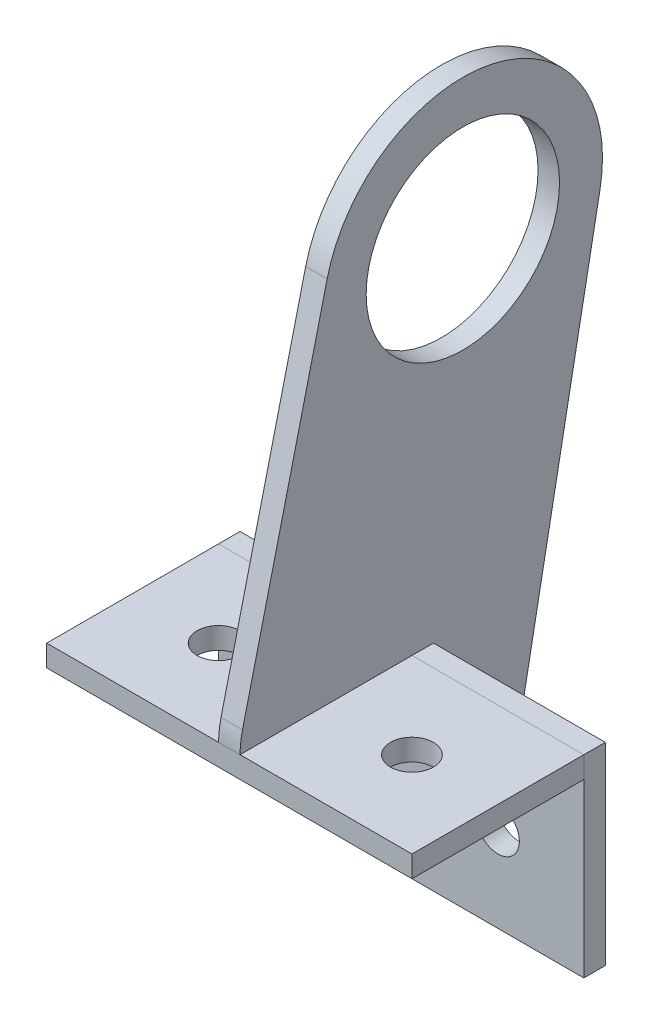
ISO-10303-21;
HEADER;
FILE_DESCRIPTION(('STEP AP214'),'2;1');
FILE_NAME('part.step','',(''),(''),'','','');
FILE_SCHEMA(('AUTOMOTIVE_DESIGN { 1 0 10303 214 1 1 1 1 }'));
ENDSEC;
DATA;
#1=APPLICATION_CONTEXT('core data for automotive mechanical design processes');
#2=APPLICATION_PROTOCOL_DEFINITION('international standard','automotive_design',2000,#1);
#3=PRODUCT_CONTEXT('',#1,'mechanical');
#4=PRODUCT('Part','Part','',(#3));
#5=PRODUCT_RELATED_PRODUCT_CATEGORY('part','',(#4));
#6=PRODUCT_DEFINITION_FORMATION('','',#4);
#7=PRODUCT_DEFINITION_CONTEXT('part definition',#1,'design');
#8=PRODUCT_DEFINITION('design','',#6,#7);
#9=PRODUCT_DEFINITION_SHAPE('','',#8);
#10=(LENGTH_UNIT() NAMED_UNIT(*) SI_UNIT(.MILLI.,.METRE.));
#11=(NAMED_UNIT(*) PLANE_ANGLE_UNIT() SI_UNIT($,.RADIAN.));
#12=(NAMED_UNIT(*) SI_UNIT($,.STERADIAN.) SOLID_ANGLE_UNIT());
#13=UNCERTAINTY_MEASURE_WITH_UNIT(LENGTH_MEASURE(1.E-05),#10,'distance_accuracy_value','');
#14=(GEOMETRIC_REPRESENTATION_CONTEXT(3) GLOBAL_UNCERTAINTY_ASSIGNED_CONTEXT((#13)) GLOBAL_UNIT_ASSIGNED_CONTEXT((#10,
#11,#12)) REPRESENTATION_CONTEXT('',''));
#15=CARTESIAN_POINT('',(0.,0.,0.));
#16=DIRECTION('',(0.,0.,1.));
#17=DIRECTION('',(1.,0.,0.));
#18=AXIS2_PLACEMENT_3D('',#15,#16,#17);
#19=CARTESIAN_POINT('',(-26.9875,-49.5999999999818,32.9250000000001));
#20=DIRECTION('',(1.,0.,0.));
#21=DIRECTION('',(0.,0.,-1.));
#22=AXIS2_PLACEMENT_3D('',#19,#20,#21);
#23=PLANE('',#22);
#24=DIRECTION('',(0.,-1.,0.));
#25=VECTOR('',#24,1.);
#26=CARTESIAN_POINT('',(-26.9875,-49.5999999999818,7.5250000000001));
#27=LINE('',#26,#25);
#28=CARTESIAN_POINT('',(-26.9875,-49.5999999999818,7.5250000000001));
#29=VERTEX_POINT('',#28);
#30=CARTESIAN_POINT('',(-26.9875,-52.7749999999818,7.5250000000001));
#31=VERTEX_POINT('',#30);
#32=EDGE_CURVE('E113',#29,#31,#27,.T.);
#33=ORIENTED_EDGE('',*,*,#32,.T.);
#34=DIRECTION('',(0.,0.,-1.));
#35=VECTOR('',#34,1.);
#36=CARTESIAN_POINT('',(-26.9875,-52.7749999999818,32.9250000000001));
#37=LINE('',#36,#35);
#38=CARTESIAN_POINT('',(-26.9875,-52.7749999999818,32.9250000000001));
#39=VERTEX_POINT('',#38);
#40=EDGE_CURVE('E12',#39,#31,#37,.T.);
#41=ORIENTED_EDGE('',*,*,#40,.F.);
#42=DIRECTION('',(0.,-1.,0.));
#43=VECTOR('',#42,1.);
#44=CARTESIAN_POINT('',(-26.9875,-49.5999999999818,32.9250000000001));
#45=LINE('',#44,#43);
#46=CARTESIAN_POINT('',(-26.9875,-49.5999999999818,32.9250000000001));
#47=VERTEX_POINT('',#46);
#48=EDGE_CURVE('E101',#47,#39,#45,.T.);
#49=ORIENTED_EDGE('',*,*,#48,.F.);
#50=DIRECTION('',(0.,0.,-1.));
#51=VECTOR('',#50,1.);
#52=CARTESIAN_POINT('',(-26.9875,-49.5999999999818,32.9250000000001));
#53=LINE('',#52,#51);
#54=EDGE_CURVE('E109',#47,#29,#53,.T.);
#55=ORIENTED_EDGE('',*,*,#54,.T.);
#56=EDGE_LOOP('',(#33,#41,#49,#55));
#57=FACE_BOUND('',#56,.T.);
#58=ADVANCED_FACE('F50',(#57),#23,.F.);
#59=CARTESIAN_POINT('',(-26.9875,-52.7749999999818,32.9250000000001));
#60=DIRECTION('',(0.,1.,0.));
#61=DIRECTION('',(0.,0.,1.));
#62=AXIS2_PLACEMENT_3D('',#59,#60,#61);
#63=PLANE('',#62);
#64=CARTESIAN_POINT('',(14.2875,-52.7749999999818,20.225));
#65=DIRECTION('',(0.,1.,0.));
#66=DIRECTION('',(0.,0.,1.));
#67=AXIS2_PLACEMENT_3D('',#64,#65,#66);
#68=CIRCLE('',#67,3.175);
#69=CARTESIAN_POINT('',(14.2875,-52.7749999999818,23.4000000000001));
#70=VERTEX_POINT('',#69);
#71=EDGE_CURVE('E132',#70,#70,#68,.T.);
#72=ORIENTED_EDGE('',*,*,#71,.T.);
#73=EDGE_LOOP('',(#72));
#74=FACE_BOUND('',#73,.T.);
#75=CARTESIAN_POINT('',(-14.2875,-52.7749999999818,20.225));
#76=DIRECTION('',(0.,1.,0.));
#77=DIRECTION('',(0.,0.,1.));
#78=AXIS2_PLACEMENT_3D('',#75,#76,#77);
#79=CIRCLE('',#78,3.175);
#80=CARTESIAN_POINT('',(-14.2875,-52.7749999999818,23.4));
#81=VERTEX_POINT('',#80);
#82=EDGE_CURVE('E116',#81,#81,#79,.T.);
#83=ORIENTED_EDGE('',*,*,#82,.T.);
#84=EDGE_LOOP('',(#83));
#85=FACE_BOUND('',#84,.T.);
#86=DIRECTION('',(1.,0.,0.));
#87=VECTOR('',#86,1.);
#88=CARTESIAN_POINT('',(-26.9875,-52.7749999999818,7.5250000000001));
#89=LINE('',#88,#87);
#90=CARTESIAN_POINT('',(26.9875,-52.7749999999818,7.5250000000001));
#91=VERTEX_POINT('',#90);
#92=EDGE_CURVE('E105',#31,#91,#89,.T.);
#93=ORIENTED_EDGE('',*,*,#92,.T.);
#94=DIRECTION('',(0.,0.,-1.));
#95=VECTOR('',#94,1.);
#96=CARTESIAN_POINT('',(26.9875,-52.7749999999818,32.9250000000001));
#97=LINE('',#96,#95);
#98=CARTESIAN_POINT('',(26.9875,-52.7749999999818,32.9250000000001));
#99=VERTEX_POINT('',#98);
#100=EDGE_CURVE('E58',#99,#91,#97,.T.);
#101=ORIENTED_EDGE('',*,*,#100,.F.);
#102=DIRECTION('',(1.,0.,0.));
#103=VECTOR('',#102,1.);
#104=CARTESIAN_POINT('',(-26.9875,-52.7749999999818,32.9250000000001));
#105=LINE('',#104,#103);
#106=EDGE_CURVE('E96',#39,#99,#105,.T.);
#107=ORIENTED_EDGE('',*,*,#106,.F.);
#108=ORIENTED_EDGE('',*,*,#40,.T.);
#109=EDGE_LOOP('',(#93,#101,#107,#108));
#110=FACE_BOUND('',#109,.T.);
#111=ADVANCED_FACE('F104',(#74,#85,#110),#63,.F.);
#112=CARTESIAN_POINT('',(26.9875,-49.5999999999818,32.9250000000001));
#113=DIRECTION('',(-1.,0.,0.));
#114=DIRECTION('',(0.,0.,1.));
#115=AXIS2_PLACEMENT_3D('',#112,#113,#114);
#116=PLANE('',#115);
#117=DIRECTION('',(0.,1.,0.));
#118=VECTOR('',#117,1.);
#119=CARTESIAN_POINT('',(26.9875,-49.5999999999818,7.5250000000001));
#120=LINE('',#119,#118);
#121=CARTESIAN_POINT('',(26.9875,-49.5999999999818,7.5250000000001));
#122=VERTEX_POINT('',#121);
#123=EDGE_CURVE('E83',#91,#122,#120,.T.);
#124=ORIENTED_EDGE('',*,*,#123,.T.);
#125=DIRECTION('',(0.,0.,-1.));
#126=VECTOR('',#125,1.);
#127=CARTESIAN_POINT('',(26.9875,-49.5999999999818,32.9250000000001));
#128=LINE('',#127,#126);
#129=CARTESIAN_POINT('',(26.9875,-49.5999999999818,32.9250000000001));
#130=VERTEX_POINT('',#129);
#131=EDGE_CURVE('E106',#130,#122,#128,.T.);
#132=ORIENTED_EDGE('',*,*,#131,.F.);
#133=DIRECTION('',(0.,1.,0.));
#134=VECTOR('',#133,1.);
#135=CARTESIAN_POINT('',(26.9875,-49.5999999999818,32.9250000000001));
#136=LINE('',#135,#134);
#137=EDGE_CURVE('E99',#99,#130,#136,.T.);
#138=ORIENTED_EDGE('',*,*,#137,.F.);
#139=ORIENTED_EDGE('',*,*,#100,.T.);
#140=EDGE_LOOP('',(#124,#132,#138,#139));
#141=FACE_BOUND('',#140,.T.);
#142=ADVANCED_FACE('F107',(#141),#116,.F.);
#143=CARTESIAN_POINT('',(-26.9875,-49.5999999999818,32.9250000000001));
#144=DIRECTION('',(0.,-1.,0.));
#145=DIRECTION('',(0.,0.,-1.));
#146=AXIS2_PLACEMENT_3D('',#143,#144,#145);
#147=PLANE('',#146);
#148=CARTESIAN_POINT('',(14.2875,-49.5999999999818,20.225));
#149=DIRECTION('',(0.,1.,0.));
#150=DIRECTION('',(0.,0.,1.));
#151=AXIS2_PLACEMENT_3D('',#148,#149,#150);
#152=CIRCLE('',#151,3.175);
#153=CARTESIAN_POINT('',(14.2875,-49.5999999999818,23.4000000000001));
#154=VERTEX_POINT('',#153);
#155=EDGE_CURVE('E135',#154,#154,#152,.T.);
#156=ORIENTED_EDGE('',*,*,#155,.F.);
#157=EDGE_LOOP('',(#156));
#158=FACE_BOUND('',#157,.T.);
#159=CARTESIAN_POINT('',(-14.2875,-49.5999999999818,20.225));
#160=DIRECTION('',(0.,1.,0.));
#161=DIRECTION('',(0.,0.,1.));
#162=AXIS2_PLACEMENT_3D('',#159,#160,#161);
#163=CIRCLE('',#162,3.175);
#164=CARTESIAN_POINT('',(-14.2875,-49.5999999999818,23.4));
#165=VERTEX_POINT('',#164);
#166=EDGE_CURVE('E129',#165,#165,#163,.T.);
#167=ORIENTED_EDGE('',*,*,#166,.F.);
#168=EDGE_LOOP('',(#167));
#169=FACE_BOUND('',#168,.T.);
#170=DIRECTION('',(-1.,0.,0.));
#171=VECTOR('',#170,1.);
#172=CARTESIAN_POINT('',(-26.9875,-49.5999999999818,7.5250000000001));
#173=LINE('',#172,#171);
#174=EDGE_CURVE('E89',#122,#29,#173,.T.);
#175=ORIENTED_EDGE('',*,*,#174,.T.);
#176=ORIENTED_EDGE('',*,*,#54,.F.);
#177=DIRECTION('',(-1.,0.,0.));
#178=VECTOR('',#177,1.);
#179=CARTESIAN_POINT('',(-26.9875,-49.5999999999818,32.9250000000001));
#180=LINE('',#179,#178);
#181=EDGE_CURVE('E66',#130,#47,#180,.T.);
#182=ORIENTED_EDGE('',*,*,#181,.F.);
#183=ORIENTED_EDGE('',*,*,#131,.T.);
#184=EDGE_LOOP('',(#175,#176,#182,#183));
#185=FACE_BOUND('',#184,.T.);
#186=ADVANCED_FACE('F121',(#158,#169,#185),#147,.F.);
#187=CARTESIAN_POINT('',(0.,0.,32.9250000000001));
#188=DIRECTION('',(0.,0.,1.));
#189=DIRECTION('',(1.,0.,0.));
#190=AXIS2_PLACEMENT_3D('',#187,#188,#189);
#191=PLANE('',#190);
#192=ORIENTED_EDGE('',*,*,#48,.T.);
#193=ORIENTED_EDGE('',*,*,#106,.T.);
#194=ORIENTED_EDGE('',*,*,#137,.T.);
#195=ORIENTED_EDGE('',*,*,#181,.T.);
#196=EDGE_LOOP('',(#192,#193,#194,#195));
#197=FACE_BOUND('',#196,.T.);
#198=ADVANCED_FACE('F97',(#197),#191,.T.);
#199=CARTESIAN_POINT('',(0.,0.,7.5250000000001));
#200=DIRECTION('',(0.,0.,1.));
#201=DIRECTION('',(1.,0.,0.));
#202=AXIS2_PLACEMENT_3D('',#199,#200,#201);
#203=PLANE('',#202);
#204=ORIENTED_EDGE('',*,*,#32,.F.);
#205=ORIENTED_EDGE('',*,*,#174,.F.);
#206=ORIENTED_EDGE('',*,*,#123,.F.);
#207=ORIENTED_EDGE('',*,*,#92,.F.);
#208=EDGE_LOOP('',(#204,#205,#206,#207));
#209=FACE_BOUND('',#208,.T.);
#210=ADVANCED_FACE('F124',(#209),#203,.F.);
#211=CARTESIAN_POINT('',(-14.2875,-78.1749999999818,20.225));
#212=DIRECTION('',(0.,1.,0.));
#213=DIRECTION('',(0.,0.,1.));
#214=AXIS2_PLACEMENT_3D('',#211,#212,#213);
#215=CYLINDRICAL_SURFACE('',#214,3.175);
#216=ORIENTED_EDGE('',*,*,#166,.T.);
#217=EDGE_LOOP('',(#216));
#218=FACE_BOUND('',#217,.T.);
#219=ORIENTED_EDGE('',*,*,#82,.F.);
#220=EDGE_LOOP('',(#219));
#221=FACE_BOUND('',#220,.T.);
#222=ADVANCED_FACE('F147',(#218,#221),#215,.F.);
#223=CARTESIAN_POINT('',(14.2875,-78.1749999999818,20.225));
#224=DIRECTION('',(0.,1.,0.));
#225=DIRECTION('',(0.,0.,1.));
#226=AXIS2_PLACEMENT_3D('',#223,#224,#225);
#227=CYLINDRICAL_SURFACE('',#226,3.175);
#228=ORIENTED_EDGE('',*,*,#155,.T.);
#229=EDGE_LOOP('',(#228));
#230=FACE_BOUND('',#229,.T.);
#231=ORIENTED_EDGE('',*,*,#71,.F.);
#232=EDGE_LOOP('',(#231));
#233=FACE_BOUND('',#232,.T.);
#234=ADVANCED_FACE('F139',(#230,#233),#227,.F.);
#235=CLOSED_SHELL('',(#58,#111,#142,#186,#198,#210,#222,#234));
#236=MANIFOLD_SOLID_BREP('B2',#235);
#237=CARTESIAN_POINT('',(0.,0.,7.5250000000001));
#238=DIRECTION('',(0.,0.,1.));
#239=DIRECTION('',(1.,0.,0.));
#240=AXIS2_PLACEMENT_3D('',#237,#238,#239);
#241=PLANE('',#240);
#242=CARTESIAN_POINT('',(14.2875,-65.4749999999818,7.5250000000001));
#243=DIRECTION('',(0.,0.,1.));
#244=DIRECTION('',(1.,0.,0.));
#245=AXIS2_PLACEMENT_3D('',#242,#243,#244);
#246=CIRCLE('',#245,3.175);
#247=CARTESIAN_POINT('',(17.4625,-65.4749999999818,7.5250000000001));
#248=VERTEX_POINT('',#247);
#249=EDGE_CURVE('E292',#248,#248,#246,.T.);
#250=ORIENTED_EDGE('',*,*,#249,.F.);
#251=EDGE_LOOP('',(#250));
#252=FACE_BOUND('',#251,.T.);
#253=DIRECTION('',(0.,-1.,0.));
#254=VECTOR('',#253,1.);
#255=CARTESIAN_POINT('',(-26.9875,-49.5999999999818,7.5250000000001));
#256=LINE('',#255,#254);
#257=CARTESIAN_POINT('',(-26.9875,-49.5999999999818,7.5250000000001));
#258=VERTEX_POINT('',#257);
#259=CARTESIAN_POINT('',(-26.9875,-78.1749999999818,7.5250000000001));
#260=VERTEX_POINT('',#259);
#261=EDGE_CURVE('E277',#258,#260,#256,.T.);
#262=ORIENTED_EDGE('',*,*,#261,.T.);
#263=DIRECTION('',(1.,0.,0.));
#264=VECTOR('',#263,1.);
#265=CARTESIAN_POINT('',(-26.9875,-78.1749999999818,7.5250000000001));
#266=LINE('',#265,#264);
#267=CARTESIAN_POINT('',(26.9875,-78.1749999999818,7.5250000000001));
#268=VERTEX_POINT('',#267);
#269=EDGE_CURVE('E272',#260,#268,#266,.T.);
#270=ORIENTED_EDGE('',*,*,#269,.T.);
#271=DIRECTION('',(0.,1.,0.));
#272=VECTOR('',#271,1.);
#273=CARTESIAN_POINT('',(26.9875,-49.5999999999818,7.5250000000001));
#274=LINE('',#273,#272);
#275=CARTESIAN_POINT('',(26.9875,-49.5999999999818,7.5250000000001));
#276=VERTEX_POINT('',#275);
#277=EDGE_CURVE('E275',#268,#276,#274,.T.);
#278=ORIENTED_EDGE('',*,*,#277,.T.);
#279=DIRECTION('',(-1.,0.,0.));
#280=VECTOR('',#279,1.);
#281=CARTESIAN_POINT('',(-26.9875,-49.5999999999818,7.5250000000001));
#282=LINE('',#281,#280);
#283=EDGE_CURVE('E242',#276,#258,#282,.T.);
#284=ORIENTED_EDGE('',*,*,#283,.T.);
#285=EDGE_LOOP('',(#262,#270,#278,#284));
#286=FACE_BOUND('',#285,.T.);
#287=CARTESIAN_POINT('',(-14.2875,-65.4749999999818,7.5250000000001));
#288=DIRECTION('',(0.,0.,1.));
#289=DIRECTION('',(1.,0.,0.));
#290=AXIS2_PLACEMENT_3D('',#287,#288,#289);
#291=CIRCLE('',#290,3.175);
#292=CARTESIAN_POINT('',(-11.1125,-65.4749999999818,7.5250000000001));
#293=VERTEX_POINT('',#292);
#294=EDGE_CURVE('E307',#293,#293,#291,.T.);
#295=ORIENTED_EDGE('',*,*,#294,.F.);
#296=EDGE_LOOP('',(#295));
#297=FACE_BOUND('',#296,.T.);
#298=ADVANCED_FACE('F225',(#252,#286,#297),#241,.T.);
#299=CARTESIAN_POINT('',(0.,0.,4.3500000000001));
#300=DIRECTION('',(0.,0.,1.));
#301=DIRECTION('',(1.,0.,0.));
#302=AXIS2_PLACEMENT_3D('',#299,#300,#301);
#303=PLANE('',#302);
#304=DIRECTION('',(0.,-1.,0.));
#305=VECTOR('',#304,1.);
#306=CARTESIAN_POINT('',(-26.9875,-49.5999999999818,4.3500000000001));
#307=LINE('',#306,#305);
#308=CARTESIAN_POINT('',(-26.9875,-49.5999999999818,4.3500000000001));
#309=VERTEX_POINT('',#308);
#310=CARTESIAN_POINT('',(-26.9875,-78.1749999999818,4.3500000000001));
#311=VERTEX_POINT('',#310);
#312=EDGE_CURVE('E289',#309,#311,#307,.T.);
#313=ORIENTED_EDGE('',*,*,#312,.F.);
#314=DIRECTION('',(-1.,0.,0.));
#315=VECTOR('',#314,1.);
#316=CARTESIAN_POINT('',(-26.9875,-49.5999999999818,4.3500000000001));
#317=LINE('',#316,#315);
#318=CARTESIAN_POINT('',(26.9875,-49.5999999999818,4.3500000000001));
#319=VERTEX_POINT('',#318);
#320=EDGE_CURVE('E265',#319,#309,#317,.T.);
#321=ORIENTED_EDGE('',*,*,#320,.F.);
#322=DIRECTION('',(0.,1.,0.));
#323=VECTOR('',#322,1.);
#324=CARTESIAN_POINT('',(26.9875,-49.5999999999818,4.3500000000001));
#325=LINE('',#324,#323);
#326=CARTESIAN_POINT('',(26.9875,-78.1749999999818,4.3500000000001));
#327=VERTEX_POINT('',#326);
#328=EDGE_CURVE('E259',#327,#319,#325,.T.);
#329=ORIENTED_EDGE('',*,*,#328,.F.);
#330=DIRECTION('',(1.,0.,0.));
#331=VECTOR('',#330,1.);
#332=CARTESIAN_POINT('',(-26.9875,-78.1749999999818,4.3500000000001));
#333=LINE('',#332,#331);
#334=EDGE_CURVE('E281',#311,#327,#333,.T.);
#335=ORIENTED_EDGE('',*,*,#334,.F.);
#336=EDGE_LOOP('',(#313,#321,#329,#335));
#337=FACE_BOUND('',#336,.T.);
#338=CARTESIAN_POINT('',(14.2875,-65.4749999999818,4.3500000000001));
#339=DIRECTION('',(0.,0.,1.));
#340=DIRECTION('',(1.,0.,0.));
#341=AXIS2_PLACEMENT_3D('',#338,#339,#340);
#342=CIRCLE('',#341,3.175);
#343=CARTESIAN_POINT('',(17.4625,-65.4749999999818,4.3500000000001));
#344=VERTEX_POINT('',#343);
#345=EDGE_CURVE('E304',#344,#344,#342,.T.);
#346=ORIENTED_EDGE('',*,*,#345,.T.);
#347=EDGE_LOOP('',(#346));
#348=FACE_BOUND('',#347,.T.);
#349=CARTESIAN_POINT('',(-14.2875,-65.4749999999818,4.3500000000001));
#350=DIRECTION('',(0.,0.,1.));
#351=DIRECTION('',(1.,0.,0.));
#352=AXIS2_PLACEMENT_3D('',#349,#350,#351);
#353=CIRCLE('',#352,3.175);
#354=CARTESIAN_POINT('',(-11.1125,-65.4749999999818,4.3500000000001));
#355=VERTEX_POINT('',#354);
#356=EDGE_CURVE('E310',#355,#355,#353,.T.);
#357=ORIENTED_EDGE('',*,*,#356,.T.);
#358=EDGE_LOOP('',(#357));
#359=FACE_BOUND('',#358,.T.);
#360=ADVANCED_FACE('F300',(#337,#348,#359),#303,.F.);
#361=CARTESIAN_POINT('',(-26.9875,-49.5999999999818,7.5250000000001));
#362=DIRECTION('',(1.,0.,0.));
#363=DIRECTION('',(0.,0.,-1.));
#364=AXIS2_PLACEMENT_3D('',#361,#362,#363);
#365=PLANE('',#364);
#366=ORIENTED_EDGE('',*,*,#312,.T.);
#367=DIRECTION('',(0.,0.,-1.));
#368=VECTOR('',#367,1.);
#369=CARTESIAN_POINT('',(-26.9875,-78.1749999999818,7.5250000000001));
#370=LINE('',#369,#368);
#371=EDGE_CURVE('E48',#260,#311,#370,.T.);
#372=ORIENTED_EDGE('',*,*,#371,.F.);
#373=ORIENTED_EDGE('',*,*,#261,.F.);
#374=DIRECTION('',(0.,0.,-1.));
#375=VECTOR('',#374,1.);
#376=CARTESIAN_POINT('',(-26.9875,-49.5999999999818,7.5250000000001));
#377=LINE('',#376,#375);
#378=EDGE_CURVE('E285',#258,#309,#377,.T.);
#379=ORIENTED_EDGE('',*,*,#378,.T.);
#380=EDGE_LOOP('',(#366,#372,#373,#379));
#381=FACE_BOUND('',#380,.T.);
#382=ADVANCED_FACE('F227',(#381),#365,.F.);
#383=CARTESIAN_POINT('',(-26.9875,-78.1749999999818,7.5250000000001));
#384=DIRECTION('',(0.,1.,0.));
#385=DIRECTION('',(0.,0.,1.));
#386=AXIS2_PLACEMENT_3D('',#383,#384,#385);
#387=PLANE('',#386);
#388=ORIENTED_EDGE('',*,*,#334,.T.);
#389=DIRECTION('',(0.,0.,-1.));
#390=VECTOR('',#389,1.);
#391=CARTESIAN_POINT('',(26.9875,-78.1749999999818,7.5250000000001));
#392=LINE('',#391,#390);
#393=EDGE_CURVE('E234',#268,#327,#392,.T.);
#394=ORIENTED_EDGE('',*,*,#393,.F.);
#395=ORIENTED_EDGE('',*,*,#269,.F.);
#396=ORIENTED_EDGE('',*,*,#371,.T.);
#397=EDGE_LOOP('',(#388,#394,#395,#396));
#398=FACE_BOUND('',#397,.T.);
#399=ADVANCED_FACE('F280',(#398),#387,.F.);
#400=CARTESIAN_POINT('',(26.9875,-49.5999999999818,7.5250000000001));
#401=DIRECTION('',(-1.,0.,0.));
#402=DIRECTION('',(0.,-1.,0.));
#403=AXIS2_PLACEMENT_3D('',#400,#401,#402);
#404=PLANE('',#403);
#405=ORIENTED_EDGE('',*,*,#328,.T.);
#406=DIRECTION('',(0.,0.,-1.));
#407=VECTOR('',#406,1.);
#408=CARTESIAN_POINT('',(26.9875,-49.5999999999818,7.5250000000001));
#409=LINE('',#408,#407);
#410=EDGE_CURVE('E282',#276,#319,#409,.T.);
#411=ORIENTED_EDGE('',*,*,#410,.F.);
#412=ORIENTED_EDGE('',*,*,#277,.F.);
#413=ORIENTED_EDGE('',*,*,#393,.T.);
#414=EDGE_LOOP('',(#405,#411,#412,#413));
#415=FACE_BOUND('',#414,.T.);
#416=ADVANCED_FACE('F283',(#415),#404,.F.);
#417=CARTESIAN_POINT('',(-26.9875,-49.5999999999818,7.5250000000001));
#418=DIRECTION('',(0.,-1.,0.));
#419=DIRECTION('',(0.,0.,-1.));
#420=AXIS2_PLACEMENT_3D('',#417,#418,#419);
#421=PLANE('',#420);
#422=ORIENTED_EDGE('',*,*,#320,.T.);
#423=ORIENTED_EDGE('',*,*,#378,.F.);
#424=ORIENTED_EDGE('',*,*,#283,.F.);
#425=ORIENTED_EDGE('',*,*,#410,.T.);
#426=EDGE_LOOP('',(#422,#423,#424,#425));
#427=FACE_BOUND('',#426,.T.);
#428=ADVANCED_FACE('F297',(#427),#421,.F.);
#429=CARTESIAN_POINT('',(14.2875,-65.4749999999818,7.5250000000001));
#430=DIRECTION('',(0.,0.,-1.));
#431=DIRECTION('',(-1.,0.,0.));
#432=AXIS2_PLACEMENT_3D('',#429,#430,#431);
#433=CYLINDRICAL_SURFACE('',#432,3.175);
#434=ORIENTED_EDGE('',*,*,#249,.T.);
#435=EDGE_LOOP('',(#434));
#436=FACE_BOUND('',#435,.T.);
#437=ORIENTED_EDGE('',*,*,#345,.F.);
#438=EDGE_LOOP('',(#437));
#439=FACE_BOUND('',#438,.T.);
#440=ADVANCED_FACE('F327',(#436,#439),#433,.F.);
#441=CARTESIAN_POINT('',(-14.2875,-65.4749999999818,7.5250000000001));
#442=DIRECTION('',(0.,0.,-1.));
#443=DIRECTION('',(-1.,0.,0.));
#444=AXIS2_PLACEMENT_3D('',#441,#442,#443);
#445=CYLINDRICAL_SURFACE('',#444,3.175);
#446=ORIENTED_EDGE('',*,*,#294,.T.);
#447=EDGE_LOOP('',(#446));
#448=FACE_BOUND('',#447,.T.);
#449=ORIENTED_EDGE('',*,*,#356,.F.);
#450=EDGE_LOOP('',(#449));
#451=FACE_BOUND('',#450,.T.);
#452=ADVANCED_FACE('F316',(#448,#451),#445,.F.);
#453=CLOSED_SHELL('',(#298,#360,#382,#399,#416,#428,#440,#452));
#454=MANIFOLD_SOLID_BREP('B6',#453);
#455=CARTESIAN_POINT('',(1.5875,0.,0.));
#456=DIRECTION('',(1.,0.,0.));
#457=DIRECTION('',(0.,0.,-1.));
#458=AXIS2_PLACEMENT_3D('',#455,#456,#457);
#459=PLANE('',#458);
#460=CARTESIAN_POINT('',(1.5875,0.,0.));
#461=DIRECTION('',(1.,0.,0.));
#462=DIRECTION('',(0.,0.,-1.));
#463=AXIS2_PLACEMENT_3D('',#460,#461,#462);
#464=CIRCLE('',#463,20.6375);
#465=CARTESIAN_POINT('',(1.5875,-3.84892225602898,-20.2754088421675));
#466=VERTEX_POINT('',#465);
#467=CARTESIAN_POINT('',(1.5875,4.87446496577514,20.0535781731698));
#468=VERTEX_POINT('',#467);
#469=EDGE_CURVE('E495',#466,#468,#464,.T.);
#470=ORIENTED_EDGE('',*,*,#469,.T.);
#471=DIRECTION('',(0.,-0.971705786707196,0.236194547099946));
#472=VECTOR('',#471,1.);
#473=CARTESIAN_POINT('',(1.5875,-46.6003292518125,32.5656634911814));
#474=LINE('',#473,#472);
#475=CARTESIAN_POINT('',(1.5875,-46.6003292518125,32.5656634911814));
#476=VERTEX_POINT('',#475);
#477=EDGE_CURVE('E448',#468,#476,#474,.T.);
#478=ORIENTED_EDGE('',*,*,#477,.T.);
#479=CARTESIAN_POINT('',(1.5875,-49.5999999999819,20.225));
#480=DIRECTION('',(1.,0.,0.));
#481=DIRECTION('',(0.,0.,1.));
#482=AXIS2_PLACEMENT_3D('',#479,#480,#481);
#483=CIRCLE('',#482,12.7);
#484=CARTESIAN_POINT('',(1.5875,-49.5999999999818,32.925));
#485=VERTEX_POINT('',#484);
#486=EDGE_CURVE('E507',#476,#485,#483,.T.);
#487=ORIENTED_EDGE('',*,*,#486,.T.);
#488=DIRECTION('',(0.,0.,-1.));
#489=VECTOR('',#488,1.);
#490=CARTESIAN_POINT('',(1.5875,-49.5999999999818,4.35));
#491=LINE('',#490,#489);
#492=CARTESIAN_POINT('',(1.5875,-49.5999999999818,4.35));
#493=VERTEX_POINT('',#492);
#494=EDGE_CURVE('E464',#485,#493,#491,.T.);
#495=ORIENTED_EDGE('',*,*,#494,.T.);
#496=DIRECTION('',(0.,-1.,0.));
#497=VECTOR('',#496,1.);
#498=CARTESIAN_POINT('',(1.5875,-78.1749999999818,4.34999999999995));
#499=LINE('',#498,#497);
#500=CARTESIAN_POINT('',(1.5875,-78.1749999999818,4.34999999999995));
#501=VERTEX_POINT('',#500);
#502=EDGE_CURVE('E458',#493,#501,#499,.T.);
#503=ORIENTED_EDGE('',*,*,#502,.T.);
#504=CARTESIAN_POINT('',(1.5875,-65.4749999999818,4.34999999999995));
#505=DIRECTION('',(1.,0.,0.));
#506=DIRECTION('',(0.,0.,1.));
#507=AXIS2_PLACEMENT_3D('',#504,#505,#506);
#508=CIRCLE('',#507,12.7);
#509=CARTESIAN_POINT('',(1.5875,-67.8435675421535,-8.12717467210314));
#510=VERTEX_POINT('',#509);
#511=EDGE_CURVE('E462',#501,#510,#508,.T.);
#512=ORIENTED_EDGE('',*,*,#511,.T.);
#513=DIRECTION('',(0.,0.982454698590794,-0.186501381273361));
#514=VECTOR('',#513,1.);
#515=CARTESIAN_POINT('',(1.5875,-3.84892225602898,-20.2754088421675));
#516=LINE('',#515,#514);
#517=EDGE_CURVE('E408',#510,#466,#516,.T.);
#518=ORIENTED_EDGE('',*,*,#517,.T.);
#519=EDGE_LOOP('',(#470,#478,#487,#495,#503,#512,#518));
#520=FACE_BOUND('',#519,.T.);
#521=CARTESIAN_POINT('',(1.5875,0.,0.));
#522=DIRECTION('',(1.,0.,0.));
#523=DIRECTION('',(0.,0.,-1.));
#524=AXIS2_PLACEMENT_3D('',#521,#522,#523);
#525=CIRCLE('',#524,14.2875);
#526=CARTESIAN_POINT('',(1.5875,0.,-14.2875));
#527=VERTEX_POINT('',#526);
#528=EDGE_CURVE('E486',#527,#527,#525,.T.);
#529=ORIENTED_EDGE('',*,*,#528,.F.);
#530=EDGE_LOOP('',(#529));
#531=FACE_BOUND('',#530,.T.);
#532=ADVANCED_FACE('F391',(#520,#531),#459,.T.);
#533=CARTESIAN_POINT('',(-1.5875,0.,0.));
#534=DIRECTION('',(1.,0.,0.));
#535=DIRECTION('',(0.,0.,-1.));
#536=AXIS2_PLACEMENT_3D('',#533,#534,#535);
#537=PLANE('',#536);
#538=CARTESIAN_POINT('',(-1.5875,0.,0.));
#539=DIRECTION('',(1.,0.,0.));
#540=DIRECTION('',(0.,0.,-1.));
#541=AXIS2_PLACEMENT_3D('',#538,#539,#540);
#542=CIRCLE('',#541,20.6375);
#543=CARTESIAN_POINT('',(-1.5875,-3.84892225602898,-20.2754088421675));
#544=VERTEX_POINT('',#543);
#545=CARTESIAN_POINT('',(-1.5875,4.87446496577514,20.0535781731698));
#546=VERTEX_POINT('',#545);
#547=EDGE_CURVE('E482',#544,#546,#542,.T.);
#548=ORIENTED_EDGE('',*,*,#547,.F.);
#549=DIRECTION('',(0.,0.982454698590794,-0.186501381273361));
#550=VECTOR('',#549,1.);
#551=CARTESIAN_POINT('',(-1.5875,-3.84892225602898,-20.2754088421675));
#552=LINE('',#551,#550);
#553=CARTESIAN_POINT('',(-1.5875,-67.8435675421535,-8.12717467210314));
#554=VERTEX_POINT('',#553);
#555=EDGE_CURVE('E440',#554,#544,#552,.T.);
#556=ORIENTED_EDGE('',*,*,#555,.F.);
#557=CARTESIAN_POINT('',(-1.5875,-65.4749999999818,4.34999999999995));
#558=DIRECTION('',(1.,0.,0.));
#559=DIRECTION('',(0.,0.,1.));
#560=AXIS2_PLACEMENT_3D('',#557,#558,#559);
#561=CIRCLE('',#560,12.7);
#562=CARTESIAN_POINT('',(-1.5875,-78.1749999999818,4.34999999999995));
#563=VERTEX_POINT('',#562);
#564=EDGE_CURVE('E434',#563,#554,#561,.T.);
#565=ORIENTED_EDGE('',*,*,#564,.F.);
#566=DIRECTION('',(0.,-1.,0.));
#567=VECTOR('',#566,1.);
#568=CARTESIAN_POINT('',(-1.5875,-78.1749999999818,4.34999999999995));
#569=LINE('',#568,#567);
#570=CARTESIAN_POINT('',(-1.5875,-49.5999999999818,4.35));
#571=VERTEX_POINT('',#570);
#572=EDGE_CURVE('E472',#571,#563,#569,.T.);
#573=ORIENTED_EDGE('',*,*,#572,.F.);
#574=DIRECTION('',(0.,0.,-1.));
#575=VECTOR('',#574,1.);
#576=CARTESIAN_POINT('',(-1.5875,-49.5999999999818,4.35));
#577=LINE('',#576,#575);
#578=CARTESIAN_POINT('',(-1.5875,-49.5999999999818,32.925));
#579=VERTEX_POINT('',#578);
#580=EDGE_CURVE('E490',#579,#571,#577,.T.);
#581=ORIENTED_EDGE('',*,*,#580,.F.);
#582=CARTESIAN_POINT('',(-1.5875,-49.5999999999819,20.225));
#583=DIRECTION('',(1.,0.,0.));
#584=DIRECTION('',(0.,0.,1.));
#585=AXIS2_PLACEMENT_3D('',#582,#583,#584);
#586=CIRCLE('',#585,12.7);
#587=CARTESIAN_POINT('',(-1.5875,-46.6003292518125,32.5656634911814));
#588=VERTEX_POINT('',#587);
#589=EDGE_CURVE('E488',#588,#579,#586,.T.);
#590=ORIENTED_EDGE('',*,*,#589,.F.);
#591=DIRECTION('',(0.,-0.971705786707196,0.236194547099946));
#592=VECTOR('',#591,1.);
#593=CARTESIAN_POINT('',(-1.5875,-46.6003292518125,32.5656634911814));
#594=LINE('',#593,#592);
#595=EDGE_CURVE('E485',#546,#588,#594,.T.);
#596=ORIENTED_EDGE('',*,*,#595,.F.);
#597=EDGE_LOOP('',(#548,#556,#565,#573,#581,#590,#596));
#598=FACE_BOUND('',#597,.T.);
#599=CARTESIAN_POINT('',(-1.5875,0.,0.));
#600=DIRECTION('',(1.,0.,0.));
#601=DIRECTION('',(0.,0.,-1.));
#602=AXIS2_PLACEMENT_3D('',#599,#600,#601);
#603=CIRCLE('',#602,14.2875);
#604=CARTESIAN_POINT('',(-1.5875,0.,-14.2875));
#605=VERTEX_POINT('',#604);
#606=EDGE_CURVE('E519',#605,#605,#603,.T.);
#607=ORIENTED_EDGE('',*,*,#606,.T.);
#608=EDGE_LOOP('',(#607));
#609=FACE_BOUND('',#608,.T.);
#610=ADVANCED_FACE('F511',(#598,#609),#537,.F.);
#611=CARTESIAN_POINT('',(1.5875,0.,0.));
#612=DIRECTION('',(-1.,0.,0.));
#613=DIRECTION('',(0.,0.,1.));
#614=AXIS2_PLACEMENT_3D('',#611,#612,#613);
#615=CYLINDRICAL_SURFACE('',#614,20.6375);
#616=ORIENTED_EDGE('',*,*,#547,.T.);
#617=DIRECTION('',(-1.,0.,0.));
#618=VECTOR('',#617,1.);
#619=CARTESIAN_POINT('',(1.5875,4.87446496577514,20.0535781731698));
#620=LINE('',#619,#618);
#621=EDGE_CURVE('E223',#468,#546,#620,.T.);
#622=ORIENTED_EDGE('',*,*,#621,.F.);
#623=ORIENTED_EDGE('',*,*,#469,.F.);
#624=DIRECTION('',(-1.,0.,0.));
#625=VECTOR('',#624,1.);
#626=CARTESIAN_POINT('',(1.5875,-3.84892225602898,-20.2754088421675));
#627=LINE('',#626,#625);
#628=EDGE_CURVE('E478',#466,#544,#627,.T.);
#629=ORIENTED_EDGE('',*,*,#628,.T.);
#630=EDGE_LOOP('',(#616,#622,#623,#629));
#631=FACE_BOUND('',#630,.T.);
#632=ADVANCED_FACE('F393',(#631),#615,.T.);
#633=CARTESIAN_POINT('',(1.5875,-46.6003292518125,32.5656634911814));
#634=DIRECTION('',(0.,-0.236194547099946,-0.971705786707196));
#635=DIRECTION('',(0.,0.971705786707196,-0.236194547099946));
#636=AXIS2_PLACEMENT_3D('',#633,#634,#635);
#637=PLANE('',#636);
#638=ORIENTED_EDGE('',*,*,#595,.T.);
#639=DIRECTION('',(-1.,0.,0.));
#640=VECTOR('',#639,1.);
#641=CARTESIAN_POINT('',(1.5875,-46.6003292518125,32.5656634911814));
#642=LINE('',#641,#640);
#643=EDGE_CURVE('E400',#476,#588,#642,.T.);
#644=ORIENTED_EDGE('',*,*,#643,.F.);
#645=ORIENTED_EDGE('',*,*,#477,.F.);
#646=ORIENTED_EDGE('',*,*,#621,.T.);
#647=EDGE_LOOP('',(#638,#644,#645,#646));
#648=FACE_BOUND('',#647,.T.);
#649=ADVANCED_FACE('F545',(#648),#637,.F.);
#650=CARTESIAN_POINT('',(1.5875,-49.5999999999819,20.225));
#651=DIRECTION('',(-1.,0.,0.));
#652=DIRECTION('',(0.,0.,1.));
#653=AXIS2_PLACEMENT_3D('',#650,#651,#652);
#654=CYLINDRICAL_SURFACE('',#653,12.7);
#655=ORIENTED_EDGE('',*,*,#589,.T.);
#656=DIRECTION('',(-1.,0.,0.));
#657=VECTOR('',#656,1.);
#658=CARTESIAN_POINT('',(1.5875,-49.5999999999818,32.925));
#659=LINE('',#658,#657);
#660=EDGE_CURVE('E499',#485,#579,#659,.T.);
#661=ORIENTED_EDGE('',*,*,#660,.F.);
#662=ORIENTED_EDGE('',*,*,#486,.F.);
#663=ORIENTED_EDGE('',*,*,#643,.T.);
#664=EDGE_LOOP('',(#655,#661,#662,#663));
#665=FACE_BOUND('',#664,.T.);
#666=ADVANCED_FACE('F505',(#665),#654,.T.);
#667=CARTESIAN_POINT('',(1.5875,-49.5999999999818,4.35));
#668=DIRECTION('',(0.,1.,0.));
#669=DIRECTION('',(0.,0.,1.));
#670=AXIS2_PLACEMENT_3D('',#667,#668,#669);
#671=PLANE('',#670);
#672=ORIENTED_EDGE('',*,*,#580,.T.);
#673=DIRECTION('',(-1.,0.,0.));
#674=VECTOR('',#673,1.);
#675=CARTESIAN_POINT('',(1.5875,-49.5999999999818,4.35));
#676=LINE('',#675,#674);
#677=EDGE_CURVE('E473',#493,#571,#676,.T.);
#678=ORIENTED_EDGE('',*,*,#677,.F.);
#679=ORIENTED_EDGE('',*,*,#494,.F.);
#680=ORIENTED_EDGE('',*,*,#660,.T.);
#681=EDGE_LOOP('',(#672,#678,#679,#680));
#682=FACE_BOUND('',#681,.T.);
#683=ADVANCED_FACE('F514',(#682),#671,.F.);
#684=CARTESIAN_POINT('',(1.5875,-78.1749999999818,4.34999999999995));
#685=DIRECTION('',(0.,0.,-1.));
#686=DIRECTION('',(0.,1.,0.));
#687=AXIS2_PLACEMENT_3D('',#684,#685,#686);
#688=PLANE('',#687);
#689=ORIENTED_EDGE('',*,*,#572,.T.);
#690=DIRECTION('',(-1.,0.,0.));
#691=VECTOR('',#690,1.);
#692=CARTESIAN_POINT('',(1.5875,-78.1749999999818,4.34999999999995));
#693=LINE('',#692,#691);
#694=EDGE_CURVE('E469',#501,#563,#693,.T.);
#695=ORIENTED_EDGE('',*,*,#694,.F.);
#696=ORIENTED_EDGE('',*,*,#502,.F.);
#697=ORIENTED_EDGE('',*,*,#677,.T.);
#698=EDGE_LOOP('',(#689,#695,#696,#697));
#699=FACE_BOUND('',#698,.T.);
#700=ADVANCED_FACE('F470',(#699),#688,.F.);
#701=CARTESIAN_POINT('',(1.5875,-65.4749999999818,4.34999999999995));
#702=DIRECTION('',(-1.,0.,0.));
#703=DIRECTION('',(0.,0.,1.));
#704=AXIS2_PLACEMENT_3D('',#701,#702,#703);
#705=CYLINDRICAL_SURFACE('',#704,12.7);
#706=ORIENTED_EDGE('',*,*,#564,.T.);
#707=DIRECTION('',(-1.,0.,0.));
#708=VECTOR('',#707,1.);
#709=CARTESIAN_POINT('',(1.5875,-67.8435675421535,-8.12717467210314));
#710=LINE('',#709,#708);
#711=EDGE_CURVE('E474',#510,#554,#710,.T.);
#712=ORIENTED_EDGE('',*,*,#711,.F.);
#713=ORIENTED_EDGE('',*,*,#511,.F.);
#714=ORIENTED_EDGE('',*,*,#694,.T.);
#715=EDGE_LOOP('',(#706,#712,#713,#714));
#716=FACE_BOUND('',#715,.T.);
#717=ADVANCED_FACE('F476',(#716),#705,.T.);
#718=CARTESIAN_POINT('',(1.5875,-3.84892225602898,-20.2754088421675));
#719=DIRECTION('',(0.,0.186501381273361,0.982454698590794));
#720=DIRECTION('',(0.,-0.982454698590794,0.186501381273361));
#721=AXIS2_PLACEMENT_3D('',#718,#719,#720);
#722=PLANE('',#721);
#723=ORIENTED_EDGE('',*,*,#555,.T.);
#724=ORIENTED_EDGE('',*,*,#628,.F.);
#725=ORIENTED_EDGE('',*,*,#517,.F.);
#726=ORIENTED_EDGE('',*,*,#711,.T.);
#727=EDGE_LOOP('',(#723,#724,#725,#726));
#728=FACE_BOUND('',#727,.T.);
#729=ADVANCED_FACE('F535',(#728),#722,.F.);
#730=CARTESIAN_POINT('',(1.5875,0.,0.));
#731=DIRECTION('',(-1.,0.,0.));
#732=DIRECTION('',(0.,0.,1.));
#733=AXIS2_PLACEMENT_3D('',#730,#731,#732);
#734=CYLINDRICAL_SURFACE('',#733,14.2875);
#735=ORIENTED_EDGE('',*,*,#528,.T.);
#736=EDGE_LOOP('',(#735));
#737=FACE_BOUND('',#736,.T.);
#738=ORIENTED_EDGE('',*,*,#606,.F.);
#739=EDGE_LOOP('',(#738));
#740=FACE_BOUND('',#739,.T.);
#741=ADVANCED_FACE('F525',(#737,#740),#734,.F.);
#742=CLOSED_SHELL('',(#532,#610,#632,#649,#666,#683,#700,#717,#729,#741));
#743=MANIFOLD_SOLID_BREP('B42',#742);
#744=ADVANCED_BREP_SHAPE_REPRESENTATION('',(#18,#236,#454,#743),#14);
#745=SHAPE_DEFINITION_REPRESENTATION(#9,#744);
ENDSEC;
END-ISO-10303-21;
